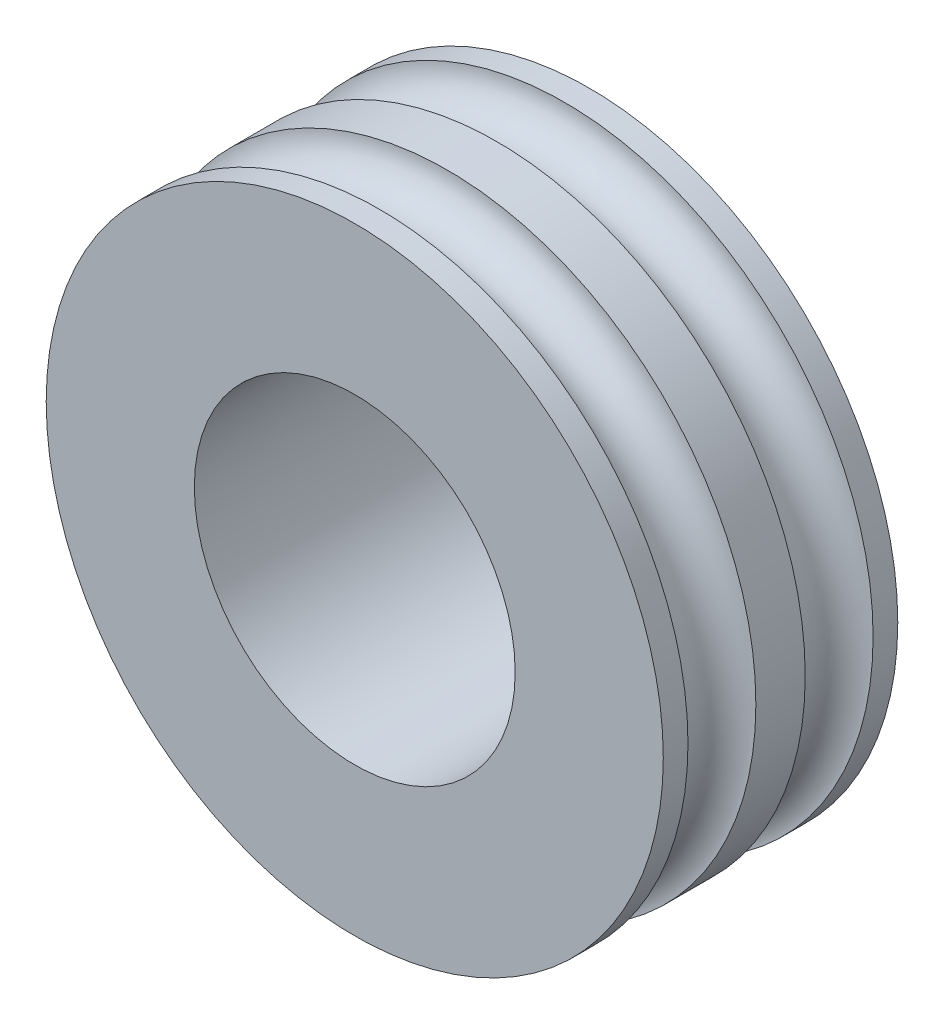
ISO-10303-21;
HEADER;
FILE_DESCRIPTION(('STEP AP214'),'2;1');
FILE_NAME('part.step','',(''),(''),'','','');
FILE_SCHEMA(('AUTOMOTIVE_DESIGN { 1 0 10303 214 1 1 1 1 }'));
ENDSEC;
DATA;
#1=APPLICATION_CONTEXT('core data for automotive mechanical design processes');
#2=APPLICATION_PROTOCOL_DEFINITION('international standard','automotive_design',2000,#1);
#3=PRODUCT_CONTEXT('',#1,'mechanical');
#4=PRODUCT('Part','Part','',(#3));
#5=PRODUCT_RELATED_PRODUCT_CATEGORY('part','',(#4));
#6=PRODUCT_DEFINITION_FORMATION('','',#4);
#7=PRODUCT_DEFINITION_CONTEXT('part definition',#1,'design');
#8=PRODUCT_DEFINITION('design','',#6,#7);
#9=PRODUCT_DEFINITION_SHAPE('','',#8);
#10=(LENGTH_UNIT() NAMED_UNIT(*) SI_UNIT(.MILLI.,.METRE.));
#11=(NAMED_UNIT(*) PLANE_ANGLE_UNIT() SI_UNIT($,.RADIAN.));
#12=(NAMED_UNIT(*) SI_UNIT($,.STERADIAN.) SOLID_ANGLE_UNIT());
#13=UNCERTAINTY_MEASURE_WITH_UNIT(LENGTH_MEASURE(1.E-05),#10,'distance_accuracy_value','');
#14=(GEOMETRIC_REPRESENTATION_CONTEXT(3) GLOBAL_UNCERTAINTY_ASSIGNED_CONTEXT((#13)) GLOBAL_UNIT_ASSIGNED_CONTEXT((#10,
#11,#12)) REPRESENTATION_CONTEXT('',''));
#15=CARTESIAN_POINT('',(0.,0.,0.));
#16=DIRECTION('',(0.,0.,1.));
#17=DIRECTION('',(1.,0.,0.));
#18=AXIS2_PLACEMENT_3D('',#15,#16,#17);
#19=CARTESIAN_POINT('',(0.,0.,3.0146773668033));
#20=DIRECTION('',(0.,0.,1.));
#21=DIRECTION('',(1.,0.,0.));
#22=AXIS2_PLACEMENT_3D('',#19,#20,#21);
#23=CYLINDRICAL_SURFACE('',#22,5.);
#24=CARTESIAN_POINT('',(0.,0.,-0.5));
#25=DIRECTION('',(0.,0.,1.));
#26=DIRECTION('',(1.,0.,0.));
#27=AXIS2_PLACEMENT_3D('',#24,#25,#26);
#28=CIRCLE('',#27,5.);
#29=CARTESIAN_POINT('',(5.,0.,-0.5));
#30=VERTEX_POINT('',#29);
#31=EDGE_CURVE('E10',#30,#30,#28,.T.);
#32=ORIENTED_EDGE('',*,*,#31,.F.);
#33=EDGE_LOOP('',(#32));
#34=FACE_BOUND('',#33,.T.);
#35=CARTESIAN_POINT('',(0.,0.,-1.3));
#36=DIRECTION('',(0.,0.,1.));
#37=DIRECTION('',(1.,0.,0.));
#38=AXIS2_PLACEMENT_3D('',#35,#36,#37);
#39=CIRCLE('',#38,5.);
#40=CARTESIAN_POINT('',(5.,0.,-1.3));
#41=VERTEX_POINT('',#40);
#42=EDGE_CURVE('E60',#41,#41,#39,.T.);
#43=ORIENTED_EDGE('',*,*,#42,.T.);
#44=EDGE_LOOP('',(#43));
#45=FACE_BOUND('',#44,.T.);
#46=ADVANCED_FACE('F37',(#34,#45),#23,.T.);
#47=CARTESIAN_POINT('',(0.,0.,0.0499999999999998));
#48=DIRECTION('',(0.,0.,1.));
#49=DIRECTION('',(1.,0.,0.));
#50=AXIS2_PLACEMENT_3D('',#47,#48,#49);
#51=TOROIDAL_SURFACE('',#50,5.,0.55);
#52=CARTESIAN_POINT('',(0.,0.,0.6));
#53=DIRECTION('',(0.,0.,1.));
#54=DIRECTION('',(1.,0.,0.));
#55=AXIS2_PLACEMENT_3D('',#52,#53,#54);
#56=CIRCLE('',#55,5.);
#57=CARTESIAN_POINT('',(5.,0.,0.6));
#58=VERTEX_POINT('',#57);
#59=EDGE_CURVE('E44',#58,#58,#56,.T.);
#60=ORIENTED_EDGE('',*,*,#59,.F.);
#61=EDGE_LOOP('',(#60));
#62=FACE_BOUND('',#61,.T.);
#63=ORIENTED_EDGE('',*,*,#31,.T.);
#64=EDGE_LOOP('',(#63));
#65=FACE_BOUND('',#64,.T.);
#66=ADVANCED_FACE('F97',(#62,#65),#51,.F.);
#67=CARTESIAN_POINT('',(0.,0.,3.0146773668033));
#68=DIRECTION('',(0.,0.,1.));
#69=DIRECTION('',(1.,0.,0.));
#70=AXIS2_PLACEMENT_3D('',#67,#68,#69);
#71=CYLINDRICAL_SURFACE('',#70,5.);
#72=CARTESIAN_POINT('',(0.,0.,1.));
#73=DIRECTION('',(0.,0.,1.));
#74=DIRECTION('',(1.,0.,0.));
#75=AXIS2_PLACEMENT_3D('',#72,#73,#74);
#76=CIRCLE('',#75,5.);
#77=CARTESIAN_POINT('',(5.,0.,1.));
#78=VERTEX_POINT('',#77);
#79=EDGE_CURVE('E49',#78,#78,#76,.T.);
#80=ORIENTED_EDGE('',*,*,#79,.F.);
#81=EDGE_LOOP('',(#80));
#82=FACE_BOUND('',#81,.T.);
#83=ORIENTED_EDGE('',*,*,#59,.T.);
#84=EDGE_LOOP('',(#83));
#85=FACE_BOUND('',#84,.T.);
#86=ADVANCED_FACE('F93',(#82,#85),#71,.T.);
#87=CARTESIAN_POINT('',(0.,5.,1.));
#88=DIRECTION('',(0.,0.,-1.));
#89=DIRECTION('',(-1.,0.,0.));
#90=AXIS2_PLACEMENT_3D('',#87,#88,#89);
#91=PLANE('',#90);
#92=CARTESIAN_POINT('',(0.,0.,1.));
#93=DIRECTION('',(0.,0.,1.));
#94=DIRECTION('',(1.,0.,0.));
#95=AXIS2_PLACEMENT_3D('',#92,#93,#94);
#96=CIRCLE('',#95,2.6);
#97=CARTESIAN_POINT('',(2.6,0.,1.));
#98=VERTEX_POINT('',#97);
#99=EDGE_CURVE('E54',#98,#98,#96,.T.);
#100=ORIENTED_EDGE('',*,*,#99,.F.);
#101=EDGE_LOOP('',(#100));
#102=FACE_BOUND('',#101,.T.);
#103=ORIENTED_EDGE('',*,*,#79,.T.);
#104=EDGE_LOOP('',(#103));
#105=FACE_BOUND('',#104,.T.);
#106=ADVANCED_FACE('F83',(#102,#105),#91,.F.);
#107=CARTESIAN_POINT('',(0.,0.,3.0146773668033));
#108=DIRECTION('',(0.,0.,1.));
#109=DIRECTION('',(1.,0.,0.));
#110=AXIS2_PLACEMENT_3D('',#107,#108,#109);
#111=CYLINDRICAL_SURFACE('',#110,2.6);
#112=ORIENTED_EDGE('',*,*,#99,.T.);
#113=EDGE_LOOP('',(#112));
#114=FACE_BOUND('',#113,.T.);
#115=CARTESIAN_POINT('',(0.,0.,-2.8));
#116=DIRECTION('',(0.,0.,1.));
#117=DIRECTION('',(1.,0.,0.));
#118=AXIS2_PLACEMENT_3D('',#115,#116,#117);
#119=CIRCLE('',#118,2.6);
#120=CARTESIAN_POINT('',(2.6,0.,-2.8));
#121=VERTEX_POINT('',#120);
#122=EDGE_CURVE('E72',#121,#121,#119,.T.);
#123=ORIENTED_EDGE('',*,*,#122,.F.);
#124=EDGE_LOOP('',(#123));
#125=FACE_BOUND('',#124,.T.);
#126=ADVANCED_FACE('F80',(#114,#125),#111,.F.);
#127=CARTESIAN_POINT('',(0.,0.,-1.85));
#128=DIRECTION('',(0.,0.,-1.));
#129=DIRECTION('',(1.,0.,0.));
#130=AXIS2_PLACEMENT_3D('',#127,#128,#129);
#131=TOROIDAL_SURFACE('',#130,5.,0.55);
#132=CARTESIAN_POINT('',(0.,0.,-2.4));
#133=DIRECTION('',(0.,0.,1.));
#134=DIRECTION('',(1.,0.,0.));
#135=AXIS2_PLACEMENT_3D('',#132,#133,#134);
#136=CIRCLE('',#135,5.);
#137=CARTESIAN_POINT('',(5.,0.,-2.4));
#138=VERTEX_POINT('',#137);
#139=EDGE_CURVE('E64',#138,#138,#136,.T.);
#140=ORIENTED_EDGE('',*,*,#139,.T.);
#141=EDGE_LOOP('',(#140));
#142=FACE_BOUND('',#141,.T.);
#143=ORIENTED_EDGE('',*,*,#42,.F.);
#144=EDGE_LOOP('',(#143));
#145=FACE_BOUND('',#144,.T.);
#146=ADVANCED_FACE('F82',(#142,#145),#131,.F.);
#147=CARTESIAN_POINT('',(0.,0.,-4.8146773668033));
#148=DIRECTION('',(0.,0.,-1.));
#149=DIRECTION('',(1.,0.,0.));
#150=AXIS2_PLACEMENT_3D('',#147,#148,#149);
#151=CYLINDRICAL_SURFACE('',#150,5.);
#152=CARTESIAN_POINT('',(0.,0.,-2.8));
#153=DIRECTION('',(0.,0.,1.));
#154=DIRECTION('',(1.,0.,0.));
#155=AXIS2_PLACEMENT_3D('',#152,#153,#154);
#156=CIRCLE('',#155,5.);
#157=CARTESIAN_POINT('',(5.,0.,-2.8));
#158=VERTEX_POINT('',#157);
#159=EDGE_CURVE('E68',#158,#158,#156,.T.);
#160=ORIENTED_EDGE('',*,*,#159,.T.);
#161=EDGE_LOOP('',(#160));
#162=FACE_BOUND('',#161,.T.);
#163=ORIENTED_EDGE('',*,*,#139,.F.);
#164=EDGE_LOOP('',(#163));
#165=FACE_BOUND('',#164,.T.);
#166=ADVANCED_FACE('F90',(#162,#165),#151,.T.);
#167=CARTESIAN_POINT('',(0.,5.,-2.8));
#168=DIRECTION('',(0.,0.,1.));
#169=DIRECTION('',(-1.,0.,0.));
#170=AXIS2_PLACEMENT_3D('',#167,#168,#169);
#171=PLANE('',#170);
#172=ORIENTED_EDGE('',*,*,#122,.T.);
#173=EDGE_LOOP('',(#172));
#174=FACE_BOUND('',#173,.T.);
#175=ORIENTED_EDGE('',*,*,#159,.F.);
#176=EDGE_LOOP('',(#175));
#177=FACE_BOUND('',#176,.T.);
#178=ADVANCED_FACE('F77',(#174,#177),#171,.F.);
#179=CLOSED_SHELL('',(#46,#66,#86,#106,#126,#146,#166,#178));
#180=MANIFOLD_SOLID_BREP('B2',#179);
#181=ADVANCED_BREP_SHAPE_REPRESENTATION('',(#18,#180),#14);
#182=SHAPE_DEFINITION_REPRESENTATION(#9,#181);
ENDSEC;
END-ISO-10303-21;
